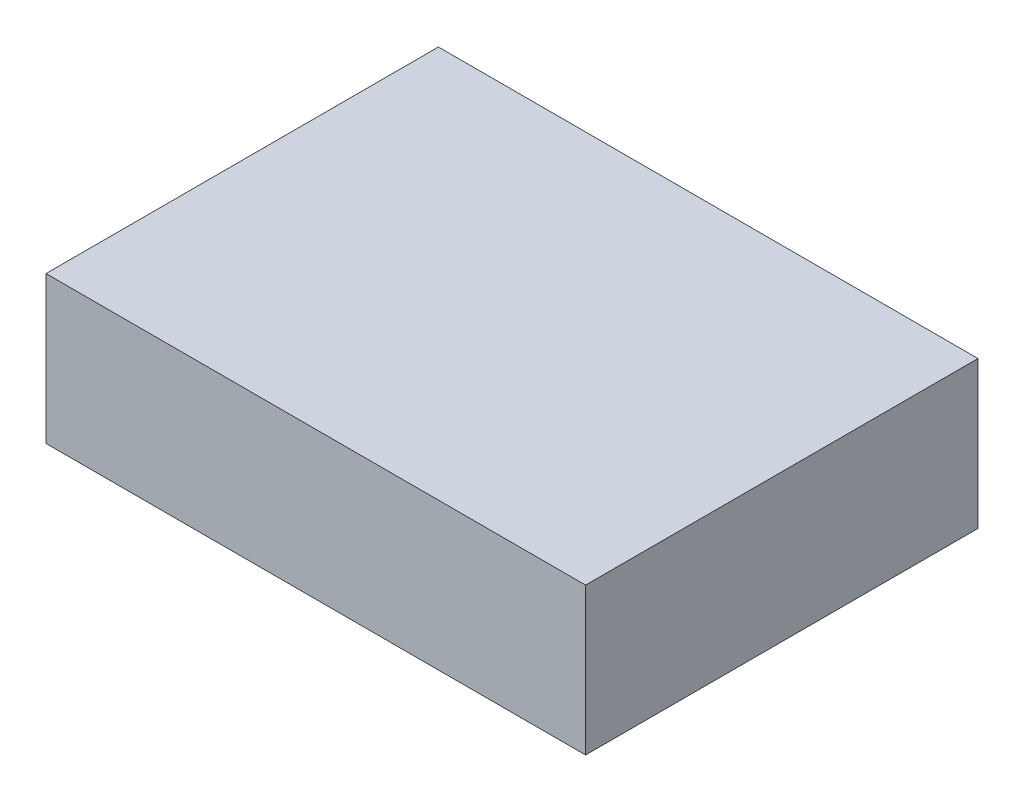
ISO-10303-21;
HEADER;
FILE_DESCRIPTION(('STEP AP214'),'2;1');
FILE_NAME('part.step','',(''),(''),'','','');
FILE_SCHEMA(('AUTOMOTIVE_DESIGN { 1 0 10303 214 1 1 1 1 }'));
ENDSEC;
DATA;
#1=APPLICATION_CONTEXT('core data for automotive mechanical design processes');
#2=APPLICATION_PROTOCOL_DEFINITION('international standard','automotive_design',2000,#1);
#3=PRODUCT_CONTEXT('',#1,'mechanical');
#4=PRODUCT('Part','Part','',(#3));
#5=PRODUCT_RELATED_PRODUCT_CATEGORY('part','',(#4));
#6=PRODUCT_DEFINITION_FORMATION('','',#4);
#7=PRODUCT_DEFINITION_CONTEXT('part definition',#1,'design');
#8=PRODUCT_DEFINITION('design','',#6,#7);
#9=PRODUCT_DEFINITION_SHAPE('','',#8);
#10=(LENGTH_UNIT() NAMED_UNIT(*) SI_UNIT(.MILLI.,.METRE.));
#11=(NAMED_UNIT(*) PLANE_ANGLE_UNIT() SI_UNIT($,.RADIAN.));
#12=(NAMED_UNIT(*) SI_UNIT($,.STERADIAN.) SOLID_ANGLE_UNIT());
#13=UNCERTAINTY_MEASURE_WITH_UNIT(LENGTH_MEASURE(1.E-05),#10,'distance_accuracy_value','');
#14=(GEOMETRIC_REPRESENTATION_CONTEXT(3) GLOBAL_UNCERTAINTY_ASSIGNED_CONTEXT((#13)) GLOBAL_UNIT_ASSIGNED_CONTEXT((#10,
#11,#12)) REPRESENTATION_CONTEXT('',''));
#15=CARTESIAN_POINT('',(0.,0.,0.));
#16=DIRECTION('',(0.,0.,1.));
#17=DIRECTION('',(1.,0.,0.));
#18=AXIS2_PLACEMENT_3D('',#15,#16,#17);
#19=CARTESIAN_POINT('',(-36.3233160621762,19.05,-16.1875647668394));
#20=DIRECTION('',(1.,0.,0.));
#21=DIRECTION('',(0.,0.,-1.));
#22=AXIS2_PLACEMENT_3D('',#19,#20,#21);
#23=PLANE('',#22);
#24=DIRECTION('',(0.,0.,1.));
#25=VECTOR('',#24,1.);
#26=CARTESIAN_POINT('',(-36.3233160621762,0.,-16.1875647668394));
#27=LINE('',#26,#25);
#28=CARTESIAN_POINT('',(-36.3233160621762,0.,-16.1875647668394));
#29=VERTEX_POINT('',#28);
#30=CARTESIAN_POINT('',(-36.3233160621762,0.,34.6124352331606));
#31=VERTEX_POINT('',#30);
#32=EDGE_CURVE('E95',#29,#31,#27,.T.);
#33=ORIENTED_EDGE('',*,*,#32,.T.);
#34=DIRECTION('',(0.,-1.,0.));
#35=VECTOR('',#34,1.);
#36=CARTESIAN_POINT('',(-36.3233160621762,19.05,34.6124352331606));
#37=LINE('',#36,#35);
#38=CARTESIAN_POINT('',(-36.3233160621762,19.05,34.6124352331606));
#39=VERTEX_POINT('',#38);
#40=EDGE_CURVE('E11',#39,#31,#37,.T.);
#41=ORIENTED_EDGE('',*,*,#40,.F.);
#42=DIRECTION('',(0.,0.,1.));
#43=VECTOR('',#42,1.);
#44=CARTESIAN_POINT('',(-36.3233160621762,19.05,-16.1875647668394));
#45=LINE('',#44,#43);
#46=CARTESIAN_POINT('',(-36.3233160621762,19.05,-16.1875647668394));
#47=VERTEX_POINT('',#46);
#48=EDGE_CURVE('E83',#47,#39,#45,.T.);
#49=ORIENTED_EDGE('',*,*,#48,.F.);
#50=DIRECTION('',(0.,-1.,0.));
#51=VECTOR('',#50,1.);
#52=CARTESIAN_POINT('',(-36.3233160621762,19.05,-16.1875647668394));
#53=LINE('',#52,#51);
#54=EDGE_CURVE('E91',#47,#29,#53,.T.);
#55=ORIENTED_EDGE('',*,*,#54,.T.);
#56=EDGE_LOOP('',(#33,#41,#49,#55));
#57=FACE_BOUND('',#56,.T.);
#58=ADVANCED_FACE('F32',(#57),#23,.F.);
#59=CARTESIAN_POINT('',(-36.3233160621762,19.05,34.6124352331606));
#60=DIRECTION('',(0.,0.,-1.));
#61=DIRECTION('',(-1.,0.,0.));
#62=AXIS2_PLACEMENT_3D('',#59,#60,#61);
#63=PLANE('',#62);
#64=DIRECTION('',(1.,0.,0.));
#65=VECTOR('',#64,1.);
#66=CARTESIAN_POINT('',(-36.3233160621762,0.,34.6124352331606));
#67=LINE('',#66,#65);
#68=CARTESIAN_POINT('',(33.5266839378238,0.,34.6124352331606));
#69=VERTEX_POINT('',#68);
#70=EDGE_CURVE('E87',#31,#69,#67,.T.);
#71=ORIENTED_EDGE('',*,*,#70,.T.);
#72=DIRECTION('',(0.,-1.,0.));
#73=VECTOR('',#72,1.);
#74=CARTESIAN_POINT('',(33.5266839378238,19.05,34.6124352331606));
#75=LINE('',#74,#73);
#76=CARTESIAN_POINT('',(33.5266839378238,19.05,34.6124352331606));
#77=VERTEX_POINT('',#76);
#78=EDGE_CURVE('E40',#77,#69,#75,.T.);
#79=ORIENTED_EDGE('',*,*,#78,.F.);
#80=DIRECTION('',(1.,0.,0.));
#81=VECTOR('',#80,1.);
#82=CARTESIAN_POINT('',(-36.3233160621762,19.05,34.6124352331606));
#83=LINE('',#82,#81);
#84=EDGE_CURVE('E78',#39,#77,#83,.T.);
#85=ORIENTED_EDGE('',*,*,#84,.F.);
#86=ORIENTED_EDGE('',*,*,#40,.T.);
#87=EDGE_LOOP('',(#71,#79,#85,#86));
#88=FACE_BOUND('',#87,.T.);
#89=ADVANCED_FACE('F86',(#88),#63,.F.);
#90=CARTESIAN_POINT('',(33.5266839378238,19.05,-16.1875647668394));
#91=DIRECTION('',(-1.,0.,0.));
#92=DIRECTION('',(0.,0.,1.));
#93=AXIS2_PLACEMENT_3D('',#90,#91,#92);
#94=PLANE('',#93);
#95=DIRECTION('',(0.,0.,-1.));
#96=VECTOR('',#95,1.);
#97=CARTESIAN_POINT('',(33.5266839378238,0.,-16.1875647668394));
#98=LINE('',#97,#96);
#99=CARTESIAN_POINT('',(33.5266839378238,0.,-16.1875647668394));
#100=VERTEX_POINT('',#99);
#101=EDGE_CURVE('E65',#69,#100,#98,.T.);
#102=ORIENTED_EDGE('',*,*,#101,.T.);
#103=DIRECTION('',(0.,-1.,0.));
#104=VECTOR('',#103,1.);
#105=CARTESIAN_POINT('',(33.5266839378238,19.05,-16.1875647668394));
#106=LINE('',#105,#104);
#107=CARTESIAN_POINT('',(33.5266839378238,19.05,-16.1875647668394));
#108=VERTEX_POINT('',#107);
#109=EDGE_CURVE('E88',#108,#100,#106,.T.);
#110=ORIENTED_EDGE('',*,*,#109,.F.);
#111=DIRECTION('',(0.,0.,-1.));
#112=VECTOR('',#111,1.);
#113=CARTESIAN_POINT('',(33.5266839378238,19.05,-16.1875647668394));
#114=LINE('',#113,#112);
#115=EDGE_CURVE('E81',#77,#108,#114,.T.);
#116=ORIENTED_EDGE('',*,*,#115,.F.);
#117=ORIENTED_EDGE('',*,*,#78,.T.);
#118=EDGE_LOOP('',(#102,#110,#116,#117));
#119=FACE_BOUND('',#118,.T.);
#120=ADVANCED_FACE('F89',(#119),#94,.F.);
#121=CARTESIAN_POINT('',(-36.3233160621762,19.05,-16.1875647668394));
#122=DIRECTION('',(0.,0.,1.));
#123=DIRECTION('',(1.,0.,0.));
#124=AXIS2_PLACEMENT_3D('',#121,#122,#123);
#125=PLANE('',#124);
#126=DIRECTION('',(-1.,0.,0.));
#127=VECTOR('',#126,1.);
#128=CARTESIAN_POINT('',(-36.3233160621762,0.,-16.1875647668394));
#129=LINE('',#128,#127);
#130=EDGE_CURVE('E71',#100,#29,#129,.T.);
#131=ORIENTED_EDGE('',*,*,#130,.T.);
#132=ORIENTED_EDGE('',*,*,#54,.F.);
#133=DIRECTION('',(-1.,0.,0.));
#134=VECTOR('',#133,1.);
#135=CARTESIAN_POINT('',(-36.3233160621762,19.05,-16.1875647668394));
#136=LINE('',#135,#134);
#137=EDGE_CURVE('E48',#108,#47,#136,.T.);
#138=ORIENTED_EDGE('',*,*,#137,.F.);
#139=ORIENTED_EDGE('',*,*,#109,.T.);
#140=EDGE_LOOP('',(#131,#132,#138,#139));
#141=FACE_BOUND('',#140,.T.);
#142=ADVANCED_FACE('F102',(#141),#125,.F.);
#143=CARTESIAN_POINT('',(0.,19.05,0.));
#144=DIRECTION('',(0.,1.,0.));
#145=DIRECTION('',(0.,0.,1.));
#146=AXIS2_PLACEMENT_3D('',#143,#144,#145);
#147=PLANE('',#146);
#148=ORIENTED_EDGE('',*,*,#48,.T.);
#149=ORIENTED_EDGE('',*,*,#84,.T.);
#150=ORIENTED_EDGE('',*,*,#115,.T.);
#151=ORIENTED_EDGE('',*,*,#137,.T.);
#152=EDGE_LOOP('',(#148,#149,#150,#151));
#153=FACE_BOUND('',#152,.T.);
#154=ADVANCED_FACE('F79',(#153),#147,.T.);
#155=CARTESIAN_POINT('',(0.,0.,0.));
#156=DIRECTION('',(0.,1.,0.));
#157=DIRECTION('',(0.,0.,1.));
#158=AXIS2_PLACEMENT_3D('',#155,#156,#157);
#159=PLANE('',#158);
#160=ORIENTED_EDGE('',*,*,#32,.F.);
#161=ORIENTED_EDGE('',*,*,#130,.F.);
#162=ORIENTED_EDGE('',*,*,#101,.F.);
#163=ORIENTED_EDGE('',*,*,#70,.F.);
#164=EDGE_LOOP('',(#160,#161,#162,#163));
#165=FACE_BOUND('',#164,.T.);
#166=ADVANCED_FACE('F105',(#165),#159,.F.);
#167=CLOSED_SHELL('',(#58,#89,#120,#142,#154,#166));
#168=MANIFOLD_SOLID_BREP('B2',#167);
#169=ADVANCED_BREP_SHAPE_REPRESENTATION('',(#18,#168),#14);
#170=SHAPE_DEFINITION_REPRESENTATION(#9,#169);
ENDSEC;
END-ISO-10303-21;
